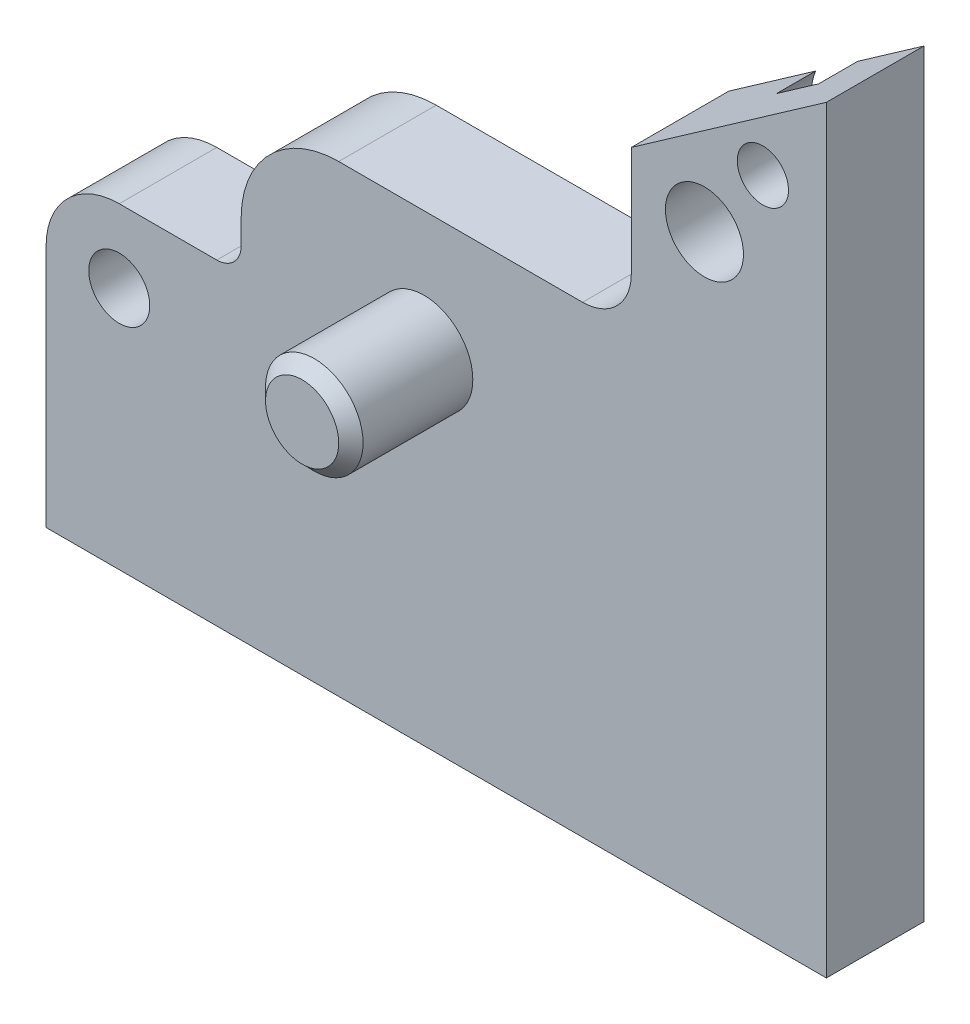
ISO-10303-21;
HEADER;
FILE_DESCRIPTION(('STEP AP214'),'2;1');
FILE_NAME('part.step','',(''),(''),'','','');
FILE_SCHEMA(('AUTOMOTIVE_DESIGN { 1 0 10303 214 1 1 1 1 }'));
ENDSEC;
DATA;
#1=APPLICATION_CONTEXT('core data for automotive mechanical design processes');
#2=APPLICATION_PROTOCOL_DEFINITION('international standard','automotive_design',2000,#1);
#3=PRODUCT_CONTEXT('',#1,'mechanical');
#4=PRODUCT('Part','Part','',(#3));
#5=PRODUCT_RELATED_PRODUCT_CATEGORY('part','',(#4));
#6=PRODUCT_DEFINITION_FORMATION('','',#4);
#7=PRODUCT_DEFINITION_CONTEXT('part definition',#1,'design');
#8=PRODUCT_DEFINITION('design','',#6,#7);
#9=PRODUCT_DEFINITION_SHAPE('','',#8);
#10=(LENGTH_UNIT() NAMED_UNIT(*) SI_UNIT(.MILLI.,.METRE.));
#11=(NAMED_UNIT(*) PLANE_ANGLE_UNIT() SI_UNIT($,.RADIAN.));
#12=(NAMED_UNIT(*) SI_UNIT($,.STERADIAN.) SOLID_ANGLE_UNIT());
#13=UNCERTAINTY_MEASURE_WITH_UNIT(LENGTH_MEASURE(1.E-05),#10,'distance_accuracy_value','');
#14=(GEOMETRIC_REPRESENTATION_CONTEXT(3) GLOBAL_UNCERTAINTY_ASSIGNED_CONTEXT((#13)) GLOBAL_UNIT_ASSIGNED_CONTEXT((#10,
#11,#12)) REPRESENTATION_CONTEXT('',''));
#15=CARTESIAN_POINT('',(0.,0.,0.));
#16=DIRECTION('',(0.,0.,1.));
#17=DIRECTION('',(1.,0.,0.));
#18=AXIS2_PLACEMENT_3D('',#15,#16,#17);
#19=CARTESIAN_POINT('',(32.,0.,0.));
#20=DIRECTION('',(1.,0.,0.));
#21=DIRECTION('',(0.,0.,-1.));
#22=AXIS2_PLACEMENT_3D('',#19,#20,#21);
#23=PLANE('',#22);
#24=DIRECTION('',(0.,1.,0.));
#25=VECTOR('',#24,1.);
#26=CARTESIAN_POINT('',(32.,0.,4.));
#27=LINE('',#26,#25);
#28=CARTESIAN_POINT('',(32.,0.,4.));
#29=VERTEX_POINT('',#28);
#30=CARTESIAN_POINT('',(32.,31.101660306,4.));
#31=VERTEX_POINT('',#30);
#32=EDGE_CURVE('E213',#29,#31,#27,.T.);
#33=ORIENTED_EDGE('',*,*,#32,.F.);
#34=DIRECTION('',(0.,0.,1.));
#35=VECTOR('',#34,1.);
#36=CARTESIAN_POINT('',(32.,0.,0.));
#37=LINE('',#36,#35);
#38=CARTESIAN_POINT('',(32.,0.,0.));
#39=VERTEX_POINT('',#38);
#40=EDGE_CURVE('E236',#39,#29,#37,.T.);
#41=ORIENTED_EDGE('',*,*,#40,.F.);
#42=DIRECTION('',(0.,1.,0.));
#43=VECTOR('',#42,1.);
#44=CARTESIAN_POINT('',(32.,0.,0.));
#45=LINE('',#44,#43);
#46=CARTESIAN_POINT('',(32.,31.101660306,0.));
#47=VERTEX_POINT('',#46);
#48=EDGE_CURVE('E217',#39,#47,#45,.T.);
#49=ORIENTED_EDGE('',*,*,#48,.T.);
#50=DIRECTION('',(0.,0.,1.));
#51=VECTOR('',#50,1.);
#52=CARTESIAN_POINT('',(32.,31.101660306,0.));
#53=LINE('',#52,#51);
#54=EDGE_CURVE('E228',#47,#31,#53,.T.);
#55=ORIENTED_EDGE('',*,*,#54,.T.);
#56=EDGE_LOOP('',(#33,#41,#49,#55));
#57=FACE_BOUND('',#56,.T.);
#58=ADVANCED_FACE('F32',(#57),#23,.T.);
#59=CARTESIAN_POINT('',(0.,0.,0.));
#60=DIRECTION('',(0.,-1.,0.));
#61=DIRECTION('',(0.,0.,-1.));
#62=AXIS2_PLACEMENT_3D('',#59,#60,#61);
#63=PLANE('',#62);
#64=CARTESIAN_POINT('',(10.,0.,2.));
#65=DIRECTION('',(0.,-1.,0.));
#66=DIRECTION('',(0.,0.,-1.));
#67=AXIS2_PLACEMENT_3D('',#64,#65,#66);
#68=CIRCLE('',#67,1.24999999999999);
#69=CARTESIAN_POINT('',(10.,0.,0.750000000000011));
#70=VERTEX_POINT('',#69);
#71=EDGE_CURVE('E151',#70,#70,#68,.T.);
#72=ORIENTED_EDGE('',*,*,#71,.F.);
#73=EDGE_LOOP('',(#72));
#74=FACE_BOUND('',#73,.T.);
#75=CARTESIAN_POINT('',(19.5,0.,2.));
#76=DIRECTION('',(0.,-1.,0.));
#77=DIRECTION('',(0.,0.,-1.));
#78=AXIS2_PLACEMENT_3D('',#75,#76,#77);
#79=CIRCLE('',#78,1.24999999999999);
#80=CARTESIAN_POINT('',(19.5,0.,0.750000000000013));
#81=VERTEX_POINT('',#80);
#82=EDGE_CURVE('E150',#81,#81,#79,.T.);
#83=ORIENTED_EDGE('',*,*,#82,.F.);
#84=EDGE_LOOP('',(#83));
#85=FACE_BOUND('',#84,.T.);
#86=CARTESIAN_POINT('',(29.,0.,2.));
#87=DIRECTION('',(0.,-1.,0.));
#88=DIRECTION('',(0.,0.,-1.));
#89=AXIS2_PLACEMENT_3D('',#86,#87,#88);
#90=CIRCLE('',#89,1.24999999999999);
#91=CARTESIAN_POINT('',(29.,0.,0.750000000000013));
#92=VERTEX_POINT('',#91);
#93=EDGE_CURVE('E161',#92,#92,#90,.T.);
#94=ORIENTED_EDGE('',*,*,#93,.F.);
#95=EDGE_LOOP('',(#94));
#96=FACE_BOUND('',#95,.T.);
#97=DIRECTION('',(1.,0.,0.));
#98=VECTOR('',#97,1.);
#99=CARTESIAN_POINT('',(0.,0.,4.));
#100=LINE('',#99,#98);
#101=CARTESIAN_POINT('',(0.,0.,4.));
#102=VERTEX_POINT('',#101);
#103=EDGE_CURVE('E221',#102,#29,#100,.T.);
#104=ORIENTED_EDGE('',*,*,#103,.F.);
#105=DIRECTION('',(0.,0.,1.));
#106=VECTOR('',#105,1.);
#107=CARTESIAN_POINT('',(0.,0.,0.));
#108=LINE('',#107,#106);
#109=CARTESIAN_POINT('',(0.,0.,0.));
#110=VERTEX_POINT('',#109);
#111=EDGE_CURVE('E239',#110,#102,#108,.T.);
#112=ORIENTED_EDGE('',*,*,#111,.F.);
#113=DIRECTION('',(1.,0.,0.));
#114=VECTOR('',#113,1.);
#115=CARTESIAN_POINT('',(0.,0.,0.));
#116=LINE('',#115,#114);
#117=EDGE_CURVE('E224',#110,#39,#116,.T.);
#118=ORIENTED_EDGE('',*,*,#117,.T.);
#119=ORIENTED_EDGE('',*,*,#40,.T.);
#120=EDGE_LOOP('',(#104,#112,#118,#119));
#121=FACE_BOUND('',#120,.T.);
#122=ADVANCED_FACE('F331',(#74,#85,#96,#121),#63,.T.);
#123=CARTESIAN_POINT('',(0.,25.5,0.));
#124=DIRECTION('',(-1.,0.,0.));
#125=DIRECTION('',(0.,0.,1.));
#126=AXIS2_PLACEMENT_3D('',#123,#124,#125);
#127=PLANE('',#126);
#128=DIRECTION('',(0.,-1.,0.));
#129=VECTOR('',#128,1.);
#130=CARTESIAN_POINT('',(0.,25.5,4.));
#131=LINE('',#130,#129);
#132=CARTESIAN_POINT('',(0.,10.,4.));
#133=VERTEX_POINT('',#132);
#134=EDGE_CURVE('E232',#133,#102,#131,.T.);
#135=ORIENTED_EDGE('',*,*,#134,.F.);
#136=DIRECTION('',(0.,0.,-1.));
#137=VECTOR('',#136,1.);
#138=CARTESIAN_POINT('',(0.,10.,0.));
#139=LINE('',#138,#137);
#140=CARTESIAN_POINT('',(0.,10.,0.));
#141=VERTEX_POINT('',#140);
#142=EDGE_CURVE('E288',#133,#141,#139,.T.);
#143=ORIENTED_EDGE('',*,*,#142,.T.);
#144=DIRECTION('',(0.,-1.,0.));
#145=VECTOR('',#144,1.);
#146=CARTESIAN_POINT('',(0.,25.5,0.));
#147=LINE('',#146,#145);
#148=EDGE_CURVE('E222',#141,#110,#147,.T.);
#149=ORIENTED_EDGE('',*,*,#148,.T.);
#150=ORIENTED_EDGE('',*,*,#111,.T.);
#151=EDGE_LOOP('',(#135,#143,#149,#150));
#152=FACE_BOUND('',#151,.T.);
#153=ADVANCED_FACE('F325',(#152),#127,.T.);
#154=CARTESIAN_POINT('',(24.,25.5,4.));
#155=DIRECTION('',(-0.573576436373195,0.819152044273483,0.));
#156=DIRECTION('',(-0.819152044273483,-0.573576436373195,0.));
#157=AXIS2_PLACEMENT_3D('',#154,#155,#156);
#158=PLANE('',#157);
#159=DIRECTION('',(0.,0.,-1.));
#160=VECTOR('',#159,1.);
#161=CARTESIAN_POINT('',(29.2839454713184,29.1998584507191,0.));
#162=LINE('',#161,#160);
#163=CARTESIAN_POINT('',(29.2839454713184,29.1998584507191,1.6));
#164=VERTEX_POINT('',#163);
#165=CARTESIAN_POINT('',(29.2839454713184,29.1998584507191,0.));
#166=VERTEX_POINT('',#165);
#167=EDGE_CURVE('E176',#164,#166,#162,.T.);
#168=ORIENTED_EDGE('',*,*,#167,.F.);
#169=DIRECTION('',(0.819152044273483,0.573576436373195,0.));
#170=VECTOR('',#169,1.);
#171=CARTESIAN_POINT('',(24.,25.5,1.6));
#172=LINE('',#171,#170);
#173=CARTESIAN_POINT('',(27.5578850091411,27.9912579036273,1.6));
#174=VERTEX_POINT('',#173);
#175=EDGE_CURVE('E254',#174,#164,#172,.T.);
#176=ORIENTED_EDGE('',*,*,#175,.F.);
#177=DIRECTION('',(0.,0.,-1.));
#178=VECTOR('',#177,1.);
#179=CARTESIAN_POINT('',(27.5578850091411,27.9912579036273,0.));
#180=LINE('',#179,#178);
#181=CARTESIAN_POINT('',(27.5578850091411,27.9912579036273,0.));
#182=VERTEX_POINT('',#181);
#183=EDGE_CURVE('E174',#182,#174,#180,.F.);
#184=ORIENTED_EDGE('',*,*,#183,.F.);
#185=DIRECTION('',(-0.819152044273483,-0.573576436373195,0.));
#186=VECTOR('',#185,1.);
#187=CARTESIAN_POINT('',(-4.08532263455438,5.83444537710152,0.));
#188=LINE('',#187,#186);
#189=CARTESIAN_POINT('',(24.,25.5,0.));
#190=VERTEX_POINT('',#189);
#191=EDGE_CURVE('E220',#182,#190,#188,.T.);
#192=ORIENTED_EDGE('',*,*,#191,.T.);
#193=DIRECTION('',(0.,0.,-1.));
#194=VECTOR('',#193,1.);
#195=CARTESIAN_POINT('',(24.,25.5,4.));
#196=LINE('',#195,#194);
#197=CARTESIAN_POINT('',(24.,25.5,4.));
#198=VERTEX_POINT('',#197);
#199=EDGE_CURVE('E200',#198,#190,#196,.T.);
#200=ORIENTED_EDGE('',*,*,#199,.F.);
#201=DIRECTION('',(-0.819152044273483,-0.573576436373195,0.));
#202=VECTOR('',#201,1.);
#203=CARTESIAN_POINT('',(-4.08532263455438,5.83444537710152,4.));
#204=LINE('',#203,#202);
#205=EDGE_CURVE('E231',#31,#198,#204,.T.);
#206=ORIENTED_EDGE('',*,*,#205,.F.);
#207=ORIENTED_EDGE('',*,*,#54,.F.);
#208=EDGE_CURVE('E225',#47,#166,#188,.T.);
#209=ORIENTED_EDGE('',*,*,#208,.T.);
#210=EDGE_LOOP('',(#168,#176,#184,#192,#200,#206,#207,#209));
#211=FACE_BOUND('',#210,.T.);
#212=ADVANCED_FACE('F340',(#211),#158,.T.);
#213=CARTESIAN_POINT('',(0.,0.,0.));
#214=DIRECTION('',(0.,0.,1.));
#215=DIRECTION('',(1.,0.,0.));
#216=AXIS2_PLACEMENT_3D('',#213,#214,#215);
#217=PLANE('',#216);
#218=CARTESIAN_POINT('',(27.,24.,0.));
#219=DIRECTION('',(0.,0.,-1.));
#220=DIRECTION('',(-1.,0.,0.));
#221=AXIS2_PLACEMENT_3D('',#218,#219,#220);
#222=CIRCLE('',#221,1.59999999999999);
#223=CARTESIAN_POINT('',(25.4,24.,0.));
#224=VERTEX_POINT('',#223);
#225=EDGE_CURVE('E178',#224,#224,#222,.T.);
#226=ORIENTED_EDGE('',*,*,#225,.F.);
#227=EDGE_LOOP('',(#226));
#228=FACE_BOUND('',#227,.T.);
#229=CARTESIAN_POINT('',(3.,10.,0.));
#230=DIRECTION('',(0.,0.,1.));
#231=DIRECTION('',(1.,0.,0.));
#232=AXIS2_PLACEMENT_3D('',#229,#230,#231);
#233=CIRCLE('',#232,1.24999999999999);
#234=CARTESIAN_POINT('',(4.24999999999999,10.,0.));
#235=VERTEX_POINT('',#234);
#236=EDGE_CURVE('E187',#235,#235,#233,.T.);
#237=ORIENTED_EDGE('',*,*,#236,.T.);
#238=EDGE_LOOP('',(#237));
#239=FACE_BOUND('',#238,.T.);
#240=CARTESIAN_POINT('',(6.,5.,0.));
#241=DIRECTION('',(0.,0.,1.));
#242=DIRECTION('',(1.,0.,0.));
#243=AXIS2_PLACEMENT_3D('',#240,#241,#242);
#244=CIRCLE('',#243,2.);
#245=CARTESIAN_POINT('',(8.,5.,0.));
#246=VERTEX_POINT('',#245);
#247=EDGE_CURVE('E190',#246,#246,#244,.T.);
#248=ORIENTED_EDGE('',*,*,#247,.T.);
#249=EDGE_LOOP('',(#248));
#250=FACE_BOUND('',#249,.T.);
#251=DIRECTION('',(0.,-1.,0.));
#252=VECTOR('',#251,1.);
#253=CARTESIAN_POINT('',(8.,25.5,0.));
#254=LINE('',#253,#252);
#255=CARTESIAN_POINT('',(8.,15.,0.));
#256=VERTEX_POINT('',#255);
#257=CARTESIAN_POINT('',(8.,14.,0.));
#258=VERTEX_POINT('',#257);
#259=EDGE_CURVE('E206',#256,#258,#254,.T.);
#260=ORIENTED_EDGE('',*,*,#259,.F.);
#261=CARTESIAN_POINT('',(12.,15.,0.));
#262=DIRECTION('',(0.,0.,1.));
#263=DIRECTION('',(1.,0.,0.));
#264=AXIS2_PLACEMENT_3D('',#261,#262,#263);
#265=CIRCLE('',#264,4.);
#266=CARTESIAN_POINT('',(12.,19.,0.));
#267=VERTEX_POINT('',#266);
#268=EDGE_CURVE('E54',#256,#267,#265,.F.);
#269=ORIENTED_EDGE('',*,*,#268,.T.);
#270=DIRECTION('',(-1.,0.,0.));
#271=VECTOR('',#270,1.);
#272=CARTESIAN_POINT('',(24.,19.,0.));
#273=LINE('',#272,#271);
#274=CARTESIAN_POINT('',(22.,19.,0.));
#275=VERTEX_POINT('',#274);
#276=EDGE_CURVE('E198',#275,#267,#273,.T.);
#277=ORIENTED_EDGE('',*,*,#276,.F.);
#278=CARTESIAN_POINT('',(22.,21.,0.));
#279=DIRECTION('',(0.,0.,1.));
#280=DIRECTION('',(1.,0.,0.));
#281=AXIS2_PLACEMENT_3D('',#278,#279,#280);
#282=CIRCLE('',#281,2.);
#283=CARTESIAN_POINT('',(24.,21.,0.));
#284=VERTEX_POINT('',#283);
#285=EDGE_CURVE('E284',#275,#284,#282,.T.);
#286=ORIENTED_EDGE('',*,*,#285,.T.);
#287=DIRECTION('',(0.,-1.,0.));
#288=VECTOR('',#287,1.);
#289=CARTESIAN_POINT('',(24.,25.5,0.));
#290=LINE('',#289,#288);
#291=EDGE_CURVE('E193',#190,#284,#290,.T.);
#292=ORIENTED_EDGE('',*,*,#291,.F.);
#293=ORIENTED_EDGE('',*,*,#191,.F.);
#294=CARTESIAN_POINT('',(29.395995182,27.202999702,0.));
#295=DIRECTION('',(0.,0.,1.));
#296=DIRECTION('',(1.,0.,0.));
#297=AXIS2_PLACEMENT_3D('',#294,#295,#296);
#298=CIRCLE('',#297,1.99999999999999);
#299=EDGE_CURVE('E249',#182,#166,#298,.T.);
#300=ORIENTED_EDGE('',*,*,#299,.T.);
#301=ORIENTED_EDGE('',*,*,#208,.F.);
#302=ORIENTED_EDGE('',*,*,#48,.F.);
#303=ORIENTED_EDGE('',*,*,#117,.F.);
#304=ORIENTED_EDGE('',*,*,#148,.F.);
#305=CARTESIAN_POINT('',(3.,10.,0.));
#306=DIRECTION('',(0.,0.,1.));
#307=DIRECTION('',(1.,0.,0.));
#308=AXIS2_PLACEMENT_3D('',#305,#306,#307);
#309=CIRCLE('',#308,3.);
#310=CARTESIAN_POINT('',(3.,13.,0.));
#311=VERTEX_POINT('',#310);
#312=EDGE_CURVE('E291',#141,#311,#309,.F.);
#313=ORIENTED_EDGE('',*,*,#312,.T.);
#314=DIRECTION('',(-1.,0.,0.));
#315=VECTOR('',#314,1.);
#316=CARTESIAN_POINT('',(8.,13.,0.));
#317=LINE('',#316,#315);
#318=CARTESIAN_POINT('',(7.,13.,0.));
#319=VERTEX_POINT('',#318);
#320=EDGE_CURVE('E210',#319,#311,#317,.T.);
#321=ORIENTED_EDGE('',*,*,#320,.F.);
#322=CARTESIAN_POINT('',(7.,14.,0.));
#323=DIRECTION('',(0.,0.,1.));
#324=DIRECTION('',(1.,0.,0.));
#325=AXIS2_PLACEMENT_3D('',#322,#323,#324);
#326=CIRCLE('',#325,1.);
#327=EDGE_CURVE('E274',#319,#258,#326,.T.);
#328=ORIENTED_EDGE('',*,*,#327,.T.);
#329=EDGE_LOOP('',(#260,#269,#277,#286,#292,#293,#300,#301,#302,#303,#304,#313,#321,#328));
#330=FACE_BOUND('',#329,.T.);
#331=ADVANCED_FACE('F306',(#228,#239,#250,#330),#217,.F.);
#332=CARTESIAN_POINT('',(0.,0.,4.));
#333=DIRECTION('',(0.,0.,1.));
#334=DIRECTION('',(1.,0.,0.));
#335=AXIS2_PLACEMENT_3D('',#332,#333,#334);
#336=PLANE('',#335);
#337=CARTESIAN_POINT('',(29.395995182,27.202999702,4.));
#338=DIRECTION('',(0.,0.,1.));
#339=DIRECTION('',(1.,0.,0.));
#340=AXIS2_PLACEMENT_3D('',#337,#338,#339);
#341=CIRCLE('',#340,1.05000000000001);
#342=CARTESIAN_POINT('',(30.445995182,27.202999702,4.));
#343=VERTEX_POINT('',#342);
#344=EDGE_CURVE('E173',#343,#343,#341,.T.);
#345=ORIENTED_EDGE('',*,*,#344,.F.);
#346=EDGE_LOOP('',(#345));
#347=FACE_BOUND('',#346,.T.);
#348=CARTESIAN_POINT('',(27.,24.,4.));
#349=DIRECTION('',(0.,0.,1.));
#350=DIRECTION('',(1.,0.,0.));
#351=AXIS2_PLACEMENT_3D('',#348,#349,#350);
#352=CIRCLE('',#351,1.59999999999999);
#353=CARTESIAN_POINT('',(28.6,24.,4.));
#354=VERTEX_POINT('',#353);
#355=EDGE_CURVE('E181',#354,#354,#352,.T.);
#356=ORIENTED_EDGE('',*,*,#355,.F.);
#357=EDGE_LOOP('',(#356));
#358=FACE_BOUND('',#357,.T.);
#359=CARTESIAN_POINT('',(3.,10.,4.));
#360=DIRECTION('',(0.,0.,1.));
#361=DIRECTION('',(1.,0.,0.));
#362=AXIS2_PLACEMENT_3D('',#359,#360,#361);
#363=CIRCLE('',#362,1.24999999999999);
#364=CARTESIAN_POINT('',(4.24999999999999,10.,4.));
#365=VERTEX_POINT('',#364);
#366=EDGE_CURVE('E184',#365,#365,#363,.T.);
#367=ORIENTED_EDGE('',*,*,#366,.F.);
#368=EDGE_LOOP('',(#367));
#369=FACE_BOUND('',#368,.T.);
#370=CARTESIAN_POINT('',(15.5,14.,4.));
#371=DIRECTION('',(0.,0.,1.));
#372=DIRECTION('',(1.,0.,0.));
#373=AXIS2_PLACEMENT_3D('',#370,#371,#372);
#374=CIRCLE('',#373,2.);
#375=CARTESIAN_POINT('',(17.5,14.,4.));
#376=VERTEX_POINT('',#375);
#377=EDGE_CURVE('E238',#376,#376,#374,.T.);
#378=ORIENTED_EDGE('',*,*,#377,.F.);
#379=EDGE_LOOP('',(#378));
#380=FACE_BOUND('',#379,.T.);
#381=DIRECTION('',(-1.,0.,0.));
#382=VECTOR('',#381,1.);
#383=CARTESIAN_POINT('',(24.,19.,4.));
#384=LINE('',#383,#382);
#385=CARTESIAN_POINT('',(22.,19.,4.));
#386=VERTEX_POINT('',#385);
#387=CARTESIAN_POINT('',(12.,19.,4.));
#388=VERTEX_POINT('',#387);
#389=EDGE_CURVE('E197',#386,#388,#384,.T.);
#390=ORIENTED_EDGE('',*,*,#389,.T.);
#391=CARTESIAN_POINT('',(12.,15.,4.));
#392=DIRECTION('',(0.,0.,1.));
#393=DIRECTION('',(1.,0.,0.));
#394=AXIS2_PLACEMENT_3D('',#391,#392,#393);
#395=CIRCLE('',#394,4.);
#396=CARTESIAN_POINT('',(8.,15.,4.));
#397=VERTEX_POINT('',#396);
#398=EDGE_CURVE('E11',#388,#397,#395,.T.);
#399=ORIENTED_EDGE('',*,*,#398,.T.);
#400=DIRECTION('',(0.,-1.,0.));
#401=VECTOR('',#400,1.);
#402=CARTESIAN_POINT('',(8.,25.5,4.));
#403=LINE('',#402,#401);
#404=CARTESIAN_POINT('',(8.,14.,4.));
#405=VERTEX_POINT('',#404);
#406=EDGE_CURVE('E207',#397,#405,#403,.T.);
#407=ORIENTED_EDGE('',*,*,#406,.T.);
#408=CARTESIAN_POINT('',(7.,14.,4.));
#409=DIRECTION('',(0.,0.,1.));
#410=DIRECTION('',(1.,0.,0.));
#411=AXIS2_PLACEMENT_3D('',#408,#409,#410);
#412=CIRCLE('',#411,1.);
#413=CARTESIAN_POINT('',(7.,13.,4.));
#414=VERTEX_POINT('',#413);
#415=EDGE_CURVE('E277',#405,#414,#412,.F.);
#416=ORIENTED_EDGE('',*,*,#415,.T.);
#417=DIRECTION('',(-1.,0.,0.));
#418=VECTOR('',#417,1.);
#419=CARTESIAN_POINT('',(8.,13.,4.));
#420=LINE('',#419,#418);
#421=CARTESIAN_POINT('',(3.,13.,4.));
#422=VERTEX_POINT('',#421);
#423=EDGE_CURVE('E209',#414,#422,#420,.T.);
#424=ORIENTED_EDGE('',*,*,#423,.T.);
#425=CARTESIAN_POINT('',(3.,10.,4.));
#426=DIRECTION('',(0.,0.,1.));
#427=DIRECTION('',(1.,0.,0.));
#428=AXIS2_PLACEMENT_3D('',#425,#426,#427);
#429=CIRCLE('',#428,3.);
#430=EDGE_CURVE('E295',#422,#133,#429,.T.);
#431=ORIENTED_EDGE('',*,*,#430,.T.);
#432=ORIENTED_EDGE('',*,*,#134,.T.);
#433=ORIENTED_EDGE('',*,*,#103,.T.);
#434=ORIENTED_EDGE('',*,*,#32,.T.);
#435=ORIENTED_EDGE('',*,*,#205,.T.);
#436=DIRECTION('',(0.,-1.,0.));
#437=VECTOR('',#436,1.);
#438=CARTESIAN_POINT('',(24.,25.5,4.));
#439=LINE('',#438,#437);
#440=CARTESIAN_POINT('',(24.,21.,4.));
#441=VERTEX_POINT('',#440);
#442=EDGE_CURVE('E194',#198,#441,#439,.T.);
#443=ORIENTED_EDGE('',*,*,#442,.T.);
#444=CARTESIAN_POINT('',(22.,21.,4.));
#445=DIRECTION('',(0.,0.,1.));
#446=DIRECTION('',(1.,0.,0.));
#447=AXIS2_PLACEMENT_3D('',#444,#445,#446);
#448=CIRCLE('',#447,2.);
#449=EDGE_CURVE('E286',#441,#386,#448,.F.);
#450=ORIENTED_EDGE('',*,*,#449,.T.);
#451=EDGE_LOOP('',(#390,#399,#407,#416,#424,#431,#432,#433,#434,#435,#443,#450));
#452=FACE_BOUND('',#451,.T.);
#453=ADVANCED_FACE('F315',(#347,#358,#369,#380,#452),#336,.T.);
#454=CARTESIAN_POINT('',(8.,13.,4.));
#455=DIRECTION('',(0.,-1.,0.));
#456=DIRECTION('',(0.,0.,-1.));
#457=AXIS2_PLACEMENT_3D('',#454,#455,#456);
#458=PLANE('',#457);
#459=ORIENTED_EDGE('',*,*,#320,.T.);
#460=DIRECTION('',(0.,0.,-1.));
#461=VECTOR('',#460,1.);
#462=CARTESIAN_POINT('',(3.,13.,4.));
#463=LINE('',#462,#461);
#464=EDGE_CURVE('E293',#311,#422,#463,.F.);
#465=ORIENTED_EDGE('',*,*,#464,.T.);
#466=ORIENTED_EDGE('',*,*,#423,.F.);
#467=DIRECTION('',(0.,0.,-1.));
#468=VECTOR('',#467,1.);
#469=CARTESIAN_POINT('',(7.,13.,0.));
#470=LINE('',#469,#468);
#471=EDGE_CURVE('E268',#414,#319,#470,.T.);
#472=ORIENTED_EDGE('',*,*,#471,.T.);
#473=EDGE_LOOP('',(#459,#465,#466,#472));
#474=FACE_BOUND('',#473,.T.);
#475=ADVANCED_FACE('F318',(#474),#458,.F.);
#476=CARTESIAN_POINT('',(8.,25.5,4.));
#477=DIRECTION('',(1.,0.,0.));
#478=DIRECTION('',(0.,0.,-1.));
#479=AXIS2_PLACEMENT_3D('',#476,#477,#478);
#480=PLANE('',#479);
#481=ORIENTED_EDGE('',*,*,#406,.F.);
#482=DIRECTION('',(0.,0.,-1.));
#483=VECTOR('',#482,1.);
#484=CARTESIAN_POINT('',(8.,15.,4.));
#485=LINE('',#484,#483);
#486=EDGE_CURVE('E297',#397,#256,#485,.T.);
#487=ORIENTED_EDGE('',*,*,#486,.T.);
#488=ORIENTED_EDGE('',*,*,#259,.T.);
#489=DIRECTION('',(0.,0.,-1.));
#490=VECTOR('',#489,1.);
#491=CARTESIAN_POINT('',(8.,14.,4.));
#492=LINE('',#491,#490);
#493=EDGE_CURVE('E271',#258,#405,#492,.F.);
#494=ORIENTED_EDGE('',*,*,#493,.T.);
#495=EDGE_LOOP('',(#481,#487,#488,#494));
#496=FACE_BOUND('',#495,.T.);
#497=ADVANCED_FACE('F303',(#496),#480,.F.);
#498=CARTESIAN_POINT('',(24.,19.,4.));
#499=DIRECTION('',(0.,-1.,0.));
#500=DIRECTION('',(0.,0.,-1.));
#501=AXIS2_PLACEMENT_3D('',#498,#499,#500);
#502=PLANE('',#501);
#503=ORIENTED_EDGE('',*,*,#276,.T.);
#504=DIRECTION('',(0.,0.,-1.));
#505=VECTOR('',#504,1.);
#506=CARTESIAN_POINT('',(12.,19.,4.));
#507=LINE('',#506,#505);
#508=EDGE_CURVE('E40',#267,#388,#507,.F.);
#509=ORIENTED_EDGE('',*,*,#508,.T.);
#510=ORIENTED_EDGE('',*,*,#389,.F.);
#511=DIRECTION('',(0.,0.,-1.));
#512=VECTOR('',#511,1.);
#513=CARTESIAN_POINT('',(22.,19.,0.));
#514=LINE('',#513,#512);
#515=EDGE_CURVE('E279',#386,#275,#514,.T.);
#516=ORIENTED_EDGE('',*,*,#515,.T.);
#517=EDGE_LOOP('',(#503,#509,#510,#516));
#518=FACE_BOUND('',#517,.T.);
#519=ADVANCED_FACE('F351',(#518),#502,.F.);
#520=CARTESIAN_POINT('',(24.,25.5,4.));
#521=DIRECTION('',(1.,0.,0.));
#522=DIRECTION('',(0.,0.,-1.));
#523=AXIS2_PLACEMENT_3D('',#520,#521,#522);
#524=PLANE('',#523);
#525=ORIENTED_EDGE('',*,*,#291,.T.);
#526=DIRECTION('',(0.,0.,-1.));
#527=VECTOR('',#526,1.);
#528=CARTESIAN_POINT('',(24.,21.,4.));
#529=LINE('',#528,#527);
#530=EDGE_CURVE('E282',#284,#441,#529,.F.);
#531=ORIENTED_EDGE('',*,*,#530,.T.);
#532=ORIENTED_EDGE('',*,*,#442,.F.);
#533=ORIENTED_EDGE('',*,*,#199,.T.);
#534=EDGE_LOOP('',(#525,#531,#532,#533));
#535=FACE_BOUND('',#534,.T.);
#536=ADVANCED_FACE('F345',(#535),#524,.F.);
#537=CARTESIAN_POINT('',(6.,5.,-5.));
#538=DIRECTION('',(0.,0.,1.));
#539=DIRECTION('',(1.,0.,0.));
#540=AXIS2_PLACEMENT_3D('',#537,#538,#539);
#541=CYLINDRICAL_SURFACE('',#540,2.);
#542=CARTESIAN_POINT('',(6.,5.,-4.50000000000011));
#543=DIRECTION('',(0.,0.,-1.));
#544=DIRECTION('',(-1.,0.,0.));
#545=AXIS2_PLACEMENT_3D('',#542,#543,#544);
#546=CIRCLE('',#545,2.);
#547=CARTESIAN_POINT('',(4.,5.,-4.50000000000011));
#548=VERTEX_POINT('',#547);
#549=EDGE_CURVE('E256',#548,#548,#546,.F.);
#550=ORIENTED_EDGE('',*,*,#549,.T.);
#551=EDGE_LOOP('',(#550));
#552=FACE_BOUND('',#551,.T.);
#553=ORIENTED_EDGE('',*,*,#247,.F.);
#554=EDGE_LOOP('',(#553));
#555=FACE_BOUND('',#554,.T.);
#556=ADVANCED_FACE('F439',(#552,#555),#541,.T.);
#557=CARTESIAN_POINT('',(8.,5.,-5.));
#558=DIRECTION('',(0.,0.,-1.));
#559=DIRECTION('',(-1.,0.,0.));
#560=AXIS2_PLACEMENT_3D('',#557,#558,#559);
#561=PLANE('',#560);
#562=CARTESIAN_POINT('',(6.,5.,-5.));
#563=DIRECTION('',(0.,0.,-1.));
#564=DIRECTION('',(-1.,0.,0.));
#565=AXIS2_PLACEMENT_3D('',#562,#563,#564);
#566=CIRCLE('',#565,1.50000000000011);
#567=CARTESIAN_POINT('',(4.49999999999989,5.,-5.));
#568=VERTEX_POINT('',#567);
#569=EDGE_CURVE('E259',#568,#568,#566,.T.);
#570=ORIENTED_EDGE('',*,*,#569,.T.);
#571=EDGE_LOOP('',(#570));
#572=FACE_BOUND('',#571,.T.);
#573=ADVANCED_FACE('F445',(#572),#561,.T.);
#574=CARTESIAN_POINT('',(15.5,14.,9.));
#575=DIRECTION('',(0.,0.,-1.));
#576=DIRECTION('',(-1.,0.,0.));
#577=AXIS2_PLACEMENT_3D('',#574,#575,#576);
#578=CYLINDRICAL_SURFACE('',#577,2.);
#579=CARTESIAN_POINT('',(15.5,14.,8.5000000000001));
#580=DIRECTION('',(0.,0.,1.));
#581=DIRECTION('',(1.,0.,0.));
#582=AXIS2_PLACEMENT_3D('',#579,#580,#581);
#583=CIRCLE('',#582,2.);
#584=CARTESIAN_POINT('',(17.5,14.,8.5000000000001));
#585=VERTEX_POINT('',#584);
#586=EDGE_CURVE('E262',#585,#585,#583,.F.);
#587=ORIENTED_EDGE('',*,*,#586,.T.);
#588=EDGE_LOOP('',(#587));
#589=FACE_BOUND('',#588,.T.);
#590=ORIENTED_EDGE('',*,*,#377,.T.);
#591=EDGE_LOOP('',(#590));
#592=FACE_BOUND('',#591,.T.);
#593=ADVANCED_FACE('F454',(#589,#592),#578,.T.);
#594=CARTESIAN_POINT('',(17.5,14.,9.));
#595=DIRECTION('',(0.,0.,1.));
#596=DIRECTION('',(1.,0.,0.));
#597=AXIS2_PLACEMENT_3D('',#594,#595,#596);
#598=PLANE('',#597);
#599=CARTESIAN_POINT('',(15.5,14.,9.));
#600=DIRECTION('',(0.,0.,1.));
#601=DIRECTION('',(1.,0.,0.));
#602=AXIS2_PLACEMENT_3D('',#599,#600,#601);
#603=CIRCLE('',#602,1.50000000000011);
#604=CARTESIAN_POINT('',(17.0000000000001,14.,9.));
#605=VERTEX_POINT('',#604);
#606=EDGE_CURVE('E265',#605,#605,#603,.T.);
#607=ORIENTED_EDGE('',*,*,#606,.T.);
#608=EDGE_LOOP('',(#607));
#609=FACE_BOUND('',#608,.T.);
#610=ADVANCED_FACE('F462',(#609),#598,.T.);
#611=CARTESIAN_POINT('',(3.,10.,4.));
#612=DIRECTION('',(0.,0.,1.));
#613=DIRECTION('',(1.,0.,0.));
#614=AXIS2_PLACEMENT_3D('',#611,#612,#613);
#615=CYLINDRICAL_SURFACE('',#614,1.24999999999999);
#616=ORIENTED_EDGE('',*,*,#366,.T.);
#617=EDGE_LOOP('',(#616));
#618=FACE_BOUND('',#617,.T.);
#619=ORIENTED_EDGE('',*,*,#236,.F.);
#620=EDGE_LOOP('',(#619));
#621=FACE_BOUND('',#620,.T.);
#622=ADVANCED_FACE('F470',(#618,#621),#615,.F.);
#623=CARTESIAN_POINT('',(27.,24.,0.));
#624=DIRECTION('',(0.,0.,-1.));
#625=DIRECTION('',(-1.,0.,0.));
#626=AXIS2_PLACEMENT_3D('',#623,#624,#625);
#627=CYLINDRICAL_SURFACE('',#626,1.59999999999999);
#628=ORIENTED_EDGE('',*,*,#355,.T.);
#629=EDGE_LOOP('',(#628));
#630=FACE_BOUND('',#629,.T.);
#631=ORIENTED_EDGE('',*,*,#225,.T.);
#632=EDGE_LOOP('',(#631));
#633=FACE_BOUND('',#632,.T.);
#634=ADVANCED_FACE('F479',(#630,#633),#627,.F.);
#635=CARTESIAN_POINT('',(29.395995182,27.202999702,0.));
#636=DIRECTION('',(0.,0.,-1.));
#637=DIRECTION('',(-1.,0.,0.));
#638=AXIS2_PLACEMENT_3D('',#635,#636,#637);
#639=CYLINDRICAL_SURFACE('',#638,1.05000000000001);
#640=ORIENTED_EDGE('',*,*,#344,.T.);
#641=EDGE_LOOP('',(#640));
#642=FACE_BOUND('',#641,.T.);
#643=CARTESIAN_POINT('',(29.395995182,27.202999702,1.6));
#644=DIRECTION('',(0.,0.,-1.));
#645=DIRECTION('',(-1.,0.,0.));
#646=AXIS2_PLACEMENT_3D('',#643,#644,#645);
#647=CIRCLE('',#646,1.05000000000001);
#648=CARTESIAN_POINT('',(28.345995182,27.202999702,1.6));
#649=VERTEX_POINT('',#648);
#650=EDGE_CURVE('E170',#649,#649,#647,.T.);
#651=ORIENTED_EDGE('',*,*,#650,.T.);
#652=EDGE_LOOP('',(#651));
#653=FACE_BOUND('',#652,.T.);
#654=ADVANCED_FACE('F487',(#642,#653),#639,.F.);
#655=CARTESIAN_POINT('',(30.445995182,27.202999702,1.6));
#656=DIRECTION('',(0.,0.,1.));
#657=DIRECTION('',(1.,0.,0.));
#658=AXIS2_PLACEMENT_3D('',#655,#656,#657);
#659=PLANE('',#658);
#660=ORIENTED_EDGE('',*,*,#175,.T.);
#661=CARTESIAN_POINT('',(29.395995182,27.202999702,1.6));
#662=DIRECTION('',(0.,0.,-1.));
#663=DIRECTION('',(-1.,0.,0.));
#664=AXIS2_PLACEMENT_3D('',#661,#662,#663);
#665=CIRCLE('',#664,1.99999999999999);
#666=EDGE_CURVE('E167',#164,#174,#665,.T.);
#667=ORIENTED_EDGE('',*,*,#666,.T.);
#668=EDGE_LOOP('',(#660,#667));
#669=FACE_BOUND('',#668,.T.);
#670=ORIENTED_EDGE('',*,*,#650,.F.);
#671=EDGE_LOOP('',(#670));
#672=FACE_BOUND('',#671,.T.);
#673=ADVANCED_FACE('F496',(#669,#672),#659,.F.);
#674=CARTESIAN_POINT('',(29.395995182,27.202999702,0.));
#675=DIRECTION('',(0.,0.,-1.));
#676=DIRECTION('',(-1.,0.,0.));
#677=AXIS2_PLACEMENT_3D('',#674,#675,#676);
#678=CYLINDRICAL_SURFACE('',#677,1.99999999999999);
#679=ORIENTED_EDGE('',*,*,#167,.T.);
#680=ORIENTED_EDGE('',*,*,#299,.F.);
#681=ORIENTED_EDGE('',*,*,#183,.T.);
#682=ORIENTED_EDGE('',*,*,#666,.F.);
#683=EDGE_LOOP('',(#679,#680,#681,#682));
#684=FACE_BOUND('',#683,.T.);
#685=ADVANCED_FACE('F504',(#684),#678,.F.);
#686=CARTESIAN_POINT('',(29.,7.49999999999999,2.));
#687=DIRECTION('',(0.,-1.,0.));
#688=DIRECTION('',(0.,0.,-1.));
#689=AXIS2_PLACEMENT_3D('',#686,#687,#688);
#690=CONICAL_SURFACE('',#689,1.24999999999999,1.02974425854996);
#691=CARTESIAN_POINT('',(29.,8.25107577399999,2.));
#692=VERTEX_POINT('',#691);
#693=VERTEX_LOOP('',#692);
#694=FACE_BOUND('',#693,.T.);
#695=CARTESIAN_POINT('',(29.,7.49999999999999,2.));
#696=DIRECTION('',(0.,-1.,0.));
#697=DIRECTION('',(0.,0.,-1.));
#698=AXIS2_PLACEMENT_3D('',#695,#696,#697);
#699=CIRCLE('',#698,1.24999999999999);
#700=CARTESIAN_POINT('',(29.,7.49999999999999,0.750000000000013));
#701=VERTEX_POINT('',#700);
#702=EDGE_CURVE('E164',#701,#701,#699,.T.);
#703=ORIENTED_EDGE('',*,*,#702,.T.);
#704=EDGE_LOOP('',(#703));
#705=FACE_BOUND('',#704,.T.);
#706=ADVANCED_FACE('F512',(#694,#705),#690,.F.);
#707=CARTESIAN_POINT('',(29.,0.,2.));
#708=DIRECTION('',(0.,-1.,0.));
#709=DIRECTION('',(0.,0.,-1.));
#710=AXIS2_PLACEMENT_3D('',#707,#708,#709);
#711=CYLINDRICAL_SURFACE('',#710,1.24999999999999);
#712=ORIENTED_EDGE('',*,*,#702,.F.);
#713=EDGE_LOOP('',(#712));
#714=FACE_BOUND('',#713,.T.);
#715=ORIENTED_EDGE('',*,*,#93,.T.);
#716=EDGE_LOOP('',(#715));
#717=FACE_BOUND('',#716,.T.);
#718=ADVANCED_FACE('F521',(#714,#717),#711,.F.);
#719=CARTESIAN_POINT('',(19.5,7.49999999999999,2.));
#720=DIRECTION('',(0.,-1.,0.));
#721=DIRECTION('',(0.,0.,-1.));
#722=AXIS2_PLACEMENT_3D('',#719,#720,#721);
#723=CONICAL_SURFACE('',#722,1.24999999999999,1.02974425854996);
#724=CARTESIAN_POINT('',(19.5,8.25107577399999,2.));
#725=VERTEX_POINT('',#724);
#726=VERTEX_LOOP('',#725);
#727=FACE_BOUND('',#726,.T.);
#728=CARTESIAN_POINT('',(19.5,7.49999999999999,2.));
#729=DIRECTION('',(0.,-1.,0.));
#730=DIRECTION('',(0.,0.,-1.));
#731=AXIS2_PLACEMENT_3D('',#728,#729,#730);
#732=CIRCLE('',#731,1.24999999999999);
#733=CARTESIAN_POINT('',(19.5,7.49999999999999,0.750000000000013));
#734=VERTEX_POINT('',#733);
#735=EDGE_CURVE('E154',#734,#734,#732,.T.);
#736=ORIENTED_EDGE('',*,*,#735,.T.);
#737=EDGE_LOOP('',(#736));
#738=FACE_BOUND('',#737,.T.);
#739=ADVANCED_FACE('F529',(#727,#738),#723,.F.);
#740=CARTESIAN_POINT('',(19.5,0.,2.));
#741=DIRECTION('',(0.,-1.,0.));
#742=DIRECTION('',(0.,0.,-1.));
#743=AXIS2_PLACEMENT_3D('',#740,#741,#742);
#744=CYLINDRICAL_SURFACE('',#743,1.24999999999999);
#745=ORIENTED_EDGE('',*,*,#735,.F.);
#746=EDGE_LOOP('',(#745));
#747=FACE_BOUND('',#746,.T.);
#748=ORIENTED_EDGE('',*,*,#82,.T.);
#749=EDGE_LOOP('',(#748));
#750=FACE_BOUND('',#749,.T.);
#751=ADVANCED_FACE('F144',(#747,#750),#744,.F.);
#752=CARTESIAN_POINT('',(10.,7.49999999999999,2.));
#753=DIRECTION('',(0.,-1.,0.));
#754=DIRECTION('',(0.,0.,-1.));
#755=AXIS2_PLACEMENT_3D('',#752,#753,#754);
#756=CONICAL_SURFACE('',#755,1.24999999999999,1.02974425854996);
#757=CARTESIAN_POINT('',(10.,8.25107577399999,2.));
#758=VERTEX_POINT('',#757);
#759=VERTEX_LOOP('',#758);
#760=FACE_BOUND('',#759,.T.);
#761=CARTESIAN_POINT('',(10.,7.49999999999999,2.));
#762=DIRECTION('',(0.,-1.,0.));
#763=DIRECTION('',(0.,0.,-1.));
#764=AXIS2_PLACEMENT_3D('',#761,#762,#763);
#765=CIRCLE('',#764,1.24999999999999);
#766=CARTESIAN_POINT('',(10.,7.49999999999999,0.750000000000013));
#767=VERTEX_POINT('',#766);
#768=EDGE_CURVE('E148',#767,#767,#765,.T.);
#769=ORIENTED_EDGE('',*,*,#768,.T.);
#770=EDGE_LOOP('',(#769));
#771=FACE_BOUND('',#770,.T.);
#772=ADVANCED_FACE('F140',(#760,#771),#756,.F.);
#773=CARTESIAN_POINT('',(10.,0.,2.));
#774=DIRECTION('',(0.,-1.,0.));
#775=DIRECTION('',(0.,0.,-1.));
#776=AXIS2_PLACEMENT_3D('',#773,#774,#775);
#777=CYLINDRICAL_SURFACE('',#776,1.24999999999999);
#778=ORIENTED_EDGE('',*,*,#768,.F.);
#779=EDGE_LOOP('',(#778));
#780=FACE_BOUND('',#779,.T.);
#781=ORIENTED_EDGE('',*,*,#71,.T.);
#782=EDGE_LOOP('',(#781));
#783=FACE_BOUND('',#782,.T.);
#784=ADVANCED_FACE('F143',(#780,#783),#777,.F.);
#785=CARTESIAN_POINT('',(6.,5.,-4.50000000000011));
#786=DIRECTION('',(0.,0.,1.));
#787=DIRECTION('',(1.,0.,0.));
#788=AXIS2_PLACEMENT_3D('',#785,#786,#787);
#789=CONICAL_SURFACE('',#788,2.,0.785398163397448);
#790=ORIENTED_EDGE('',*,*,#569,.F.);
#791=EDGE_LOOP('',(#790));
#792=FACE_BOUND('',#791,.T.);
#793=ORIENTED_EDGE('',*,*,#549,.F.);
#794=EDGE_LOOP('',(#793));
#795=FACE_BOUND('',#794,.T.);
#796=ADVANCED_FACE('F367',(#792,#795),#789,.T.);
#797=CARTESIAN_POINT('',(15.5,14.,8.5000000000001));
#798=DIRECTION('',(0.,0.,-1.));
#799=DIRECTION('',(-1.,0.,0.));
#800=AXIS2_PLACEMENT_3D('',#797,#798,#799);
#801=CONICAL_SURFACE('',#800,2.,0.785398163397448);
#802=ORIENTED_EDGE('',*,*,#606,.F.);
#803=EDGE_LOOP('',(#802));
#804=FACE_BOUND('',#803,.T.);
#805=ORIENTED_EDGE('',*,*,#586,.F.);
#806=EDGE_LOOP('',(#805));
#807=FACE_BOUND('',#806,.T.);
#808=ADVANCED_FACE('F370',(#804,#807),#801,.T.);
#809=CARTESIAN_POINT('',(7.,14.,4.));
#810=DIRECTION('',(0.,0.,1.));
#811=DIRECTION('',(1.,0.,0.));
#812=AXIS2_PLACEMENT_3D('',#809,#810,#811);
#813=CYLINDRICAL_SURFACE('',#812,1.);
#814=ORIENTED_EDGE('',*,*,#415,.F.);
#815=ORIENTED_EDGE('',*,*,#493,.F.);
#816=ORIENTED_EDGE('',*,*,#327,.F.);
#817=ORIENTED_EDGE('',*,*,#471,.F.);
#818=EDGE_LOOP('',(#814,#815,#816,#817));
#819=FACE_BOUND('',#818,.T.);
#820=ADVANCED_FACE('F312',(#819),#813,.F.);
#821=CARTESIAN_POINT('',(22.,21.,4.));
#822=DIRECTION('',(0.,0.,1.));
#823=DIRECTION('',(1.,0.,0.));
#824=AXIS2_PLACEMENT_3D('',#821,#822,#823);
#825=CYLINDRICAL_SURFACE('',#824,2.);
#826=ORIENTED_EDGE('',*,*,#449,.F.);
#827=ORIENTED_EDGE('',*,*,#530,.F.);
#828=ORIENTED_EDGE('',*,*,#285,.F.);
#829=ORIENTED_EDGE('',*,*,#515,.F.);
#830=EDGE_LOOP('',(#826,#827,#828,#829));
#831=FACE_BOUND('',#830,.T.);
#832=ADVANCED_FACE('F350',(#831),#825,.F.);
#833=CARTESIAN_POINT('',(3.,10.,0.));
#834=DIRECTION('',(0.,0.,1.));
#835=DIRECTION('',(1.,0.,0.));
#836=AXIS2_PLACEMENT_3D('',#833,#834,#835);
#837=CYLINDRICAL_SURFACE('',#836,3.);
#838=ORIENTED_EDGE('',*,*,#430,.F.);
#839=ORIENTED_EDGE('',*,*,#464,.F.);
#840=ORIENTED_EDGE('',*,*,#312,.F.);
#841=ORIENTED_EDGE('',*,*,#142,.F.);
#842=EDGE_LOOP('',(#838,#839,#840,#841));
#843=FACE_BOUND('',#842,.T.);
#844=ADVANCED_FACE('F321',(#843),#837,.T.);
#845=CARTESIAN_POINT('',(12.,15.,4.));
#846=DIRECTION('',(0.,0.,-1.));
#847=DIRECTION('',(-1.,0.,0.));
#848=AXIS2_PLACEMENT_3D('',#845,#846,#847);
#849=CYLINDRICAL_SURFACE('',#848,4.);
#850=ORIENTED_EDGE('',*,*,#398,.F.);
#851=ORIENTED_EDGE('',*,*,#508,.F.);
#852=ORIENTED_EDGE('',*,*,#268,.F.);
#853=ORIENTED_EDGE('',*,*,#486,.F.);
#854=EDGE_LOOP('',(#850,#851,#852,#853));
#855=FACE_BOUND('',#854,.T.);
#856=ADVANCED_FACE('F34',(#855),#849,.T.);
#857=CLOSED_SHELL('',(#58,#122,#153,#212,#331,#453,#475,#497,#519,#536,#556,#573,#593,#610,#622,
#634,#654,#673,#685,#706,#718,#739,#751,#772,#784,#796,#808,#820,#832,#844,#856));
#858=MANIFOLD_SOLID_BREP('B2',#857);
#859=ADVANCED_BREP_SHAPE_REPRESENTATION('',(#18,#858),#14);
#860=SHAPE_DEFINITION_REPRESENTATION(#9,#859);
ENDSEC;
END-ISO-10303-21;
